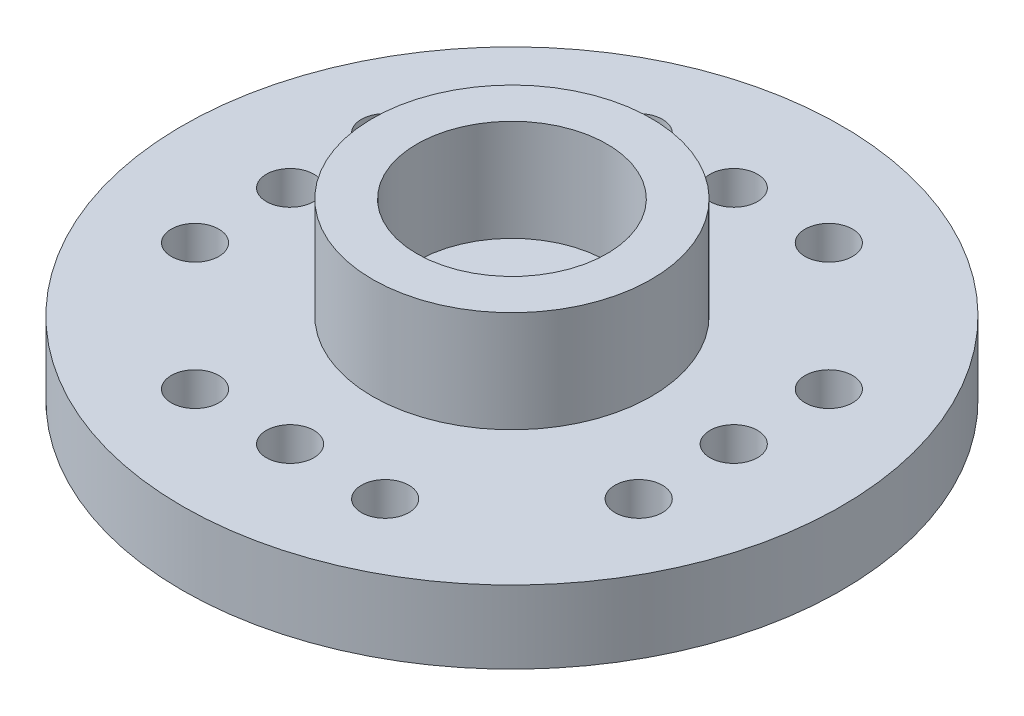
ISO-10303-21;
HEADER;
FILE_DESCRIPTION(('STEP AP214'),'2;1');
FILE_NAME('part.step','',(''),(''),'','','');
FILE_SCHEMA(('AUTOMOTIVE_DESIGN { 1 0 10303 214 1 1 1 1 }'));
ENDSEC;
DATA;
#1=APPLICATION_CONTEXT('core data for automotive mechanical design processes');
#2=APPLICATION_PROTOCOL_DEFINITION('international standard','automotive_design',2000,#1);
#3=PRODUCT_CONTEXT('',#1,'mechanical');
#4=PRODUCT('Part','Part','',(#3));
#5=PRODUCT_RELATED_PRODUCT_CATEGORY('part','',(#4));
#6=PRODUCT_DEFINITION_FORMATION('','',#4);
#7=PRODUCT_DEFINITION_CONTEXT('part definition',#1,'design');
#8=PRODUCT_DEFINITION('design','',#6,#7);
#9=PRODUCT_DEFINITION_SHAPE('','',#8);
#10=(LENGTH_UNIT() NAMED_UNIT(*) SI_UNIT(.MILLI.,.METRE.));
#11=(NAMED_UNIT(*) PLANE_ANGLE_UNIT() SI_UNIT($,.RADIAN.));
#12=(NAMED_UNIT(*) SI_UNIT($,.STERADIAN.) SOLID_ANGLE_UNIT());
#13=UNCERTAINTY_MEASURE_WITH_UNIT(LENGTH_MEASURE(1.E-05),#10,'distance_accuracy_value','');
#14=(GEOMETRIC_REPRESENTATION_CONTEXT(3) GLOBAL_UNCERTAINTY_ASSIGNED_CONTEXT((#13)) GLOBAL_UNIT_ASSIGNED_CONTEXT((#10,
#11,#12)) REPRESENTATION_CONTEXT('',''));
#15=CARTESIAN_POINT('',(0.,0.,0.));
#16=DIRECTION('',(0.,0.,1.));
#17=DIRECTION('',(1.,0.,0.));
#18=AXIS2_PLACEMENT_3D('',#15,#16,#17);
#19=CARTESIAN_POINT('',(0.,2.3,0.));
#20=DIRECTION('',(0.,1.,0.));
#21=DIRECTION('',(0.,0.,1.));
#22=AXIS2_PLACEMENT_3D('',#19,#20,#21);
#23=PLANE('',#22);
#24=CARTESIAN_POINT('',(0.,2.3,0.));
#25=DIRECTION('',(0.,1.,0.));
#26=DIRECTION('',(0.,0.,1.));
#27=AXIS2_PLACEMENT_3D('',#24,#25,#26);
#28=CIRCLE('',#27,1.5);
#29=CARTESIAN_POINT('',(0.,2.3,1.5));
#30=VERTEX_POINT('',#29);
#31=EDGE_CURVE('E119',#30,#30,#28,.T.);
#32=ORIENTED_EDGE('',*,*,#31,.F.);
#33=EDGE_LOOP('',(#32));
#34=FACE_BOUND('',#33,.T.);
#35=CARTESIAN_POINT('',(0.,2.3,0.));
#36=DIRECTION('',(0.,1.,0.));
#37=DIRECTION('',(0.,0.,1.));
#38=AXIS2_PLACEMENT_3D('',#35,#36,#37);
#39=CIRCLE('',#38,3.);
#40=CARTESIAN_POINT('',(0.,2.3,3.));
#41=VERTEX_POINT('',#40);
#42=EDGE_CURVE('E10',#41,#41,#39,.F.);
#43=ORIENTED_EDGE('',*,*,#42,.F.);
#44=EDGE_LOOP('',(#43));
#45=FACE_BOUND('',#44,.T.);
#46=ADVANCED_FACE('F32',(#34,#45),#23,.T.);
#47=CARTESIAN_POINT('',(0.,2.3,0.));
#48=DIRECTION('',(0.,1.,0.));
#49=DIRECTION('',(0.,0.,1.));
#50=AXIS2_PLACEMENT_3D('',#47,#48,#49);
#51=CIRCLE('',#50,4.4);
#52=CARTESIAN_POINT('',(0.,2.3,4.4));
#53=VERTEX_POINT('',#52);
#54=EDGE_CURVE('E128',#53,#53,#51,.T.);
#55=ORIENTED_EDGE('',*,*,#54,.F.);
#56=EDGE_LOOP('',(#55));
#57=FACE_BOUND('',#56,.T.);
#58=CARTESIAN_POINT('',(3.,2.3,-7.));
#59=DIRECTION('',(0.,1.,0.));
#60=DIRECTION('',(0.,0.,-1.));
#61=AXIS2_PLACEMENT_3D('',#58,#59,#60);
#62=CIRCLE('',#61,0.75);
#63=CARTESIAN_POINT('',(3.,2.3,-7.75));
#64=VERTEX_POINT('',#63);
#65=EDGE_CURVE('E113',#64,#64,#62,.T.);
#66=ORIENTED_EDGE('',*,*,#65,.F.);
#67=EDGE_LOOP('',(#66));
#68=FACE_BOUND('',#67,.T.);
#69=CARTESIAN_POINT('',(-3.,2.3,-7.));
#70=DIRECTION('',(0.,1.,0.));
#71=DIRECTION('',(0.,0.,-1.));
#72=AXIS2_PLACEMENT_3D('',#69,#70,#71);
#73=CIRCLE('',#72,0.750000000000002);
#74=CARTESIAN_POINT('',(-3.,2.3,-7.75));
#75=VERTEX_POINT('',#74);
#76=EDGE_CURVE('E101',#75,#75,#73,.T.);
#77=ORIENTED_EDGE('',*,*,#76,.F.);
#78=EDGE_LOOP('',(#77));
#79=FACE_BOUND('',#78,.T.);
#80=CARTESIAN_POINT('',(-7.,2.3,0.));
#81=DIRECTION('',(0.,1.,0.));
#82=DIRECTION('',(0.,0.,1.));
#83=AXIS2_PLACEMENT_3D('',#80,#81,#82);
#84=CIRCLE('',#83,0.749999999999999);
#85=CARTESIAN_POINT('',(-7.,2.3,0.750000000000004));
#86=VERTEX_POINT('',#85);
#87=EDGE_CURVE('E89',#86,#86,#84,.T.);
#88=ORIENTED_EDGE('',*,*,#87,.F.);
#89=EDGE_LOOP('',(#88));
#90=FACE_BOUND('',#89,.T.);
#91=CARTESIAN_POINT('',(-3.00000000000001,2.3,6.99999999999999));
#92=DIRECTION('',(0.,1.,0.));
#93=DIRECTION('',(0.,0.,-1.));
#94=AXIS2_PLACEMENT_3D('',#91,#92,#93);
#95=CIRCLE('',#94,0.75);
#96=CARTESIAN_POINT('',(-3.00000000000001,2.3,6.24999999999999));
#97=VERTEX_POINT('',#96);
#98=EDGE_CURVE('E77',#97,#97,#95,.T.);
#99=ORIENTED_EDGE('',*,*,#98,.F.);
#100=EDGE_LOOP('',(#99));
#101=FACE_BOUND('',#100,.T.);
#102=CARTESIAN_POINT('',(2.99999999999999,2.3,6.99999999999999));
#103=DIRECTION('',(0.,1.,0.));
#104=DIRECTION('',(0.,0.,-1.));
#105=AXIS2_PLACEMENT_3D('',#102,#103,#104);
#106=CIRCLE('',#105,0.749999999999998);
#107=CARTESIAN_POINT('',(2.99999999999999,2.3,6.24999999999999));
#108=VERTEX_POINT('',#107);
#109=EDGE_CURVE('E65',#108,#108,#106,.T.);
#110=ORIENTED_EDGE('',*,*,#109,.F.);
#111=EDGE_LOOP('',(#110));
#112=FACE_BOUND('',#111,.T.);
#113=CARTESIAN_POINT('',(7.,2.3,-3.));
#114=DIRECTION('',(0.,1.,0.));
#115=DIRECTION('',(0.,0.,1.));
#116=AXIS2_PLACEMENT_3D('',#113,#114,#115);
#117=CIRCLE('',#116,0.75);
#118=CARTESIAN_POINT('',(7.,2.3,-2.25));
#119=VERTEX_POINT('',#118);
#120=EDGE_CURVE('E53',#119,#119,#117,.T.);
#121=ORIENTED_EDGE('',*,*,#120,.F.);
#122=EDGE_LOOP('',(#121));
#123=FACE_BOUND('',#122,.T.);
#124=CARTESIAN_POINT('',(0.,2.3,0.));
#125=DIRECTION('',(0.,1.,0.));
#126=DIRECTION('',(0.,0.,1.));
#127=AXIS2_PLACEMENT_3D('',#124,#125,#126);
#128=CIRCLE('',#127,10.4);
#129=CARTESIAN_POINT('',(0.,2.3,10.4));
#130=VERTEX_POINT('',#129);
#131=EDGE_CURVE('E39',#130,#130,#128,.T.);
#132=ORIENTED_EDGE('',*,*,#131,.T.);
#133=EDGE_LOOP('',(#132));
#134=FACE_BOUND('',#133,.T.);
#135=CARTESIAN_POINT('',(7.,2.3,0.));
#136=DIRECTION('',(0.,1.,0.));
#137=DIRECTION('',(0.,0.,1.));
#138=AXIS2_PLACEMENT_3D('',#135,#136,#137);
#139=CIRCLE('',#138,0.75);
#140=CARTESIAN_POINT('',(7.,2.3,0.749999999999998));
#141=VERTEX_POINT('',#140);
#142=EDGE_CURVE('E48',#141,#141,#139,.T.);
#143=ORIENTED_EDGE('',*,*,#142,.F.);
#144=EDGE_LOOP('',(#143));
#145=FACE_BOUND('',#144,.T.);
#146=CARTESIAN_POINT('',(7.,2.3,3.));
#147=DIRECTION('',(0.,1.,0.));
#148=DIRECTION('',(0.,0.,1.));
#149=AXIS2_PLACEMENT_3D('',#146,#147,#148);
#150=CIRCLE('',#149,0.75);
#151=CARTESIAN_POINT('',(7.,2.3,3.75));
#152=VERTEX_POINT('',#151);
#153=EDGE_CURVE('E59',#152,#152,#150,.T.);
#154=ORIENTED_EDGE('',*,*,#153,.F.);
#155=EDGE_LOOP('',(#154));
#156=FACE_BOUND('',#155,.T.);
#157=CARTESIAN_POINT('',(0.,2.3,6.99999999999999));
#158=DIRECTION('',(0.,1.,0.));
#159=DIRECTION('',(0.,0.,-1.));
#160=AXIS2_PLACEMENT_3D('',#157,#158,#159);
#161=CIRCLE('',#160,0.75);
#162=CARTESIAN_POINT('',(0.,2.3,6.24999999999999));
#163=VERTEX_POINT('',#162);
#164=EDGE_CURVE('E71',#163,#163,#161,.T.);
#165=ORIENTED_EDGE('',*,*,#164,.F.);
#166=EDGE_LOOP('',(#165));
#167=FACE_BOUND('',#166,.T.);
#168=CARTESIAN_POINT('',(-7.,2.3,3.));
#169=DIRECTION('',(0.,1.,0.));
#170=DIRECTION('',(0.,0.,1.));
#171=AXIS2_PLACEMENT_3D('',#168,#169,#170);
#172=CIRCLE('',#171,0.749999999999999);
#173=CARTESIAN_POINT('',(-7.,2.3,3.75));
#174=VERTEX_POINT('',#173);
#175=EDGE_CURVE('E83',#174,#174,#172,.T.);
#176=ORIENTED_EDGE('',*,*,#175,.F.);
#177=EDGE_LOOP('',(#176));
#178=FACE_BOUND('',#177,.T.);
#179=CARTESIAN_POINT('',(-6.99999999999999,2.3,-2.99999999999999));
#180=DIRECTION('',(0.,1.,0.));
#181=DIRECTION('',(0.,0.,1.));
#182=AXIS2_PLACEMENT_3D('',#179,#180,#181);
#183=CIRCLE('',#182,0.749999999999998);
#184=CARTESIAN_POINT('',(-6.99999999999999,2.3,-2.25));
#185=VERTEX_POINT('',#184);
#186=EDGE_CURVE('E95',#185,#185,#183,.T.);
#187=ORIENTED_EDGE('',*,*,#186,.F.);
#188=EDGE_LOOP('',(#187));
#189=FACE_BOUND('',#188,.T.);
#190=CARTESIAN_POINT('',(0.,2.3,-7.));
#191=DIRECTION('',(0.,1.,0.));
#192=DIRECTION('',(0.,0.,-1.));
#193=AXIS2_PLACEMENT_3D('',#190,#191,#192);
#194=CIRCLE('',#193,0.749999999999998);
#195=CARTESIAN_POINT('',(0.,2.3,-7.75));
#196=VERTEX_POINT('',#195);
#197=EDGE_CURVE('E107',#196,#196,#194,.T.);
#198=ORIENTED_EDGE('',*,*,#197,.F.);
#199=EDGE_LOOP('',(#198));
#200=FACE_BOUND('',#199,.T.);
#201=ADVANCED_FACE('F156',(#57,#68,#79,#90,#101,#112,#123,#134,#145,#156,#167,#178,#189,#200),
#23,.T.);
#202=CARTESIAN_POINT('',(0.,0.,0.));
#203=DIRECTION('',(0.,1.,0.));
#204=DIRECTION('',(0.,0.,1.));
#205=AXIS2_PLACEMENT_3D('',#202,#203,#204);
#206=PLANE('',#205);
#207=CARTESIAN_POINT('',(0.,0.,0.));
#208=DIRECTION('',(0.,1.,0.));
#209=DIRECTION('',(0.,0.,1.));
#210=AXIS2_PLACEMENT_3D('',#207,#208,#209);
#211=CIRCLE('',#210,10.4);
#212=CARTESIAN_POINT('',(0.,0.,10.4));
#213=VERTEX_POINT('',#212);
#214=EDGE_CURVE('E43',#213,#213,#211,.T.);
#215=ORIENTED_EDGE('',*,*,#214,.F.);
#216=EDGE_LOOP('',(#215));
#217=FACE_BOUND('',#216,.T.);
#218=CARTESIAN_POINT('',(7.,0.,0.));
#219=DIRECTION('',(0.,1.,0.));
#220=DIRECTION('',(0.,0.,1.));
#221=AXIS2_PLACEMENT_3D('',#218,#219,#220);
#222=CIRCLE('',#221,0.75);
#223=CARTESIAN_POINT('',(7.,0.,0.749999999999998));
#224=VERTEX_POINT('',#223);
#225=EDGE_CURVE('E50',#224,#224,#222,.T.);
#226=ORIENTED_EDGE('',*,*,#225,.T.);
#227=EDGE_LOOP('',(#226));
#228=FACE_BOUND('',#227,.T.);
#229=CARTESIAN_POINT('',(7.,0.,-3.));
#230=DIRECTION('',(0.,1.,0.));
#231=DIRECTION('',(0.,0.,1.));
#232=AXIS2_PLACEMENT_3D('',#229,#230,#231);
#233=CIRCLE('',#232,0.75);
#234=CARTESIAN_POINT('',(7.,0.,-2.25));
#235=VERTEX_POINT('',#234);
#236=EDGE_CURVE('E56',#235,#235,#233,.T.);
#237=ORIENTED_EDGE('',*,*,#236,.T.);
#238=EDGE_LOOP('',(#237));
#239=FACE_BOUND('',#238,.T.);
#240=CARTESIAN_POINT('',(7.,0.,3.));
#241=DIRECTION('',(0.,1.,0.));
#242=DIRECTION('',(0.,0.,1.));
#243=AXIS2_PLACEMENT_3D('',#240,#241,#242);
#244=CIRCLE('',#243,0.75);
#245=CARTESIAN_POINT('',(7.,0.,3.75));
#246=VERTEX_POINT('',#245);
#247=EDGE_CURVE('E62',#246,#246,#244,.T.);
#248=ORIENTED_EDGE('',*,*,#247,.T.);
#249=EDGE_LOOP('',(#248));
#250=FACE_BOUND('',#249,.T.);
#251=CARTESIAN_POINT('',(2.99999999999999,0.,6.99999999999999));
#252=DIRECTION('',(0.,1.,0.));
#253=DIRECTION('',(0.,0.,-1.));
#254=AXIS2_PLACEMENT_3D('',#251,#252,#253);
#255=CIRCLE('',#254,0.749999999999998);
#256=CARTESIAN_POINT('',(2.99999999999999,0.,6.24999999999999));
#257=VERTEX_POINT('',#256);
#258=EDGE_CURVE('E68',#257,#257,#255,.T.);
#259=ORIENTED_EDGE('',*,*,#258,.T.);
#260=EDGE_LOOP('',(#259));
#261=FACE_BOUND('',#260,.T.);
#262=CARTESIAN_POINT('',(0.,0.,6.99999999999999));
#263=DIRECTION('',(0.,1.,0.));
#264=DIRECTION('',(0.,0.,-1.));
#265=AXIS2_PLACEMENT_3D('',#262,#263,#264);
#266=CIRCLE('',#265,0.75);
#267=CARTESIAN_POINT('',(0.,0.,6.24999999999999));
#268=VERTEX_POINT('',#267);
#269=EDGE_CURVE('E74',#268,#268,#266,.T.);
#270=ORIENTED_EDGE('',*,*,#269,.T.);
#271=EDGE_LOOP('',(#270));
#272=FACE_BOUND('',#271,.T.);
#273=CARTESIAN_POINT('',(-3.00000000000001,0.,6.99999999999999));
#274=DIRECTION('',(0.,1.,0.));
#275=DIRECTION('',(0.,0.,-1.));
#276=AXIS2_PLACEMENT_3D('',#273,#274,#275);
#277=CIRCLE('',#276,0.75);
#278=CARTESIAN_POINT('',(-3.00000000000001,0.,6.24999999999999));
#279=VERTEX_POINT('',#278);
#280=EDGE_CURVE('E80',#279,#279,#277,.T.);
#281=ORIENTED_EDGE('',*,*,#280,.T.);
#282=EDGE_LOOP('',(#281));
#283=FACE_BOUND('',#282,.T.);
#284=CARTESIAN_POINT('',(-7.,0.,3.));
#285=DIRECTION('',(0.,1.,0.));
#286=DIRECTION('',(0.,0.,1.));
#287=AXIS2_PLACEMENT_3D('',#284,#285,#286);
#288=CIRCLE('',#287,0.749999999999999);
#289=CARTESIAN_POINT('',(-7.,0.,3.75));
#290=VERTEX_POINT('',#289);
#291=EDGE_CURVE('E86',#290,#290,#288,.T.);
#292=ORIENTED_EDGE('',*,*,#291,.T.);
#293=EDGE_LOOP('',(#292));
#294=FACE_BOUND('',#293,.T.);
#295=CARTESIAN_POINT('',(-7.,0.,0.));
#296=DIRECTION('',(0.,1.,0.));
#297=DIRECTION('',(0.,0.,1.));
#298=AXIS2_PLACEMENT_3D('',#295,#296,#297);
#299=CIRCLE('',#298,0.749999999999999);
#300=CARTESIAN_POINT('',(-7.,0.,0.750000000000004));
#301=VERTEX_POINT('',#300);
#302=EDGE_CURVE('E92',#301,#301,#299,.T.);
#303=ORIENTED_EDGE('',*,*,#302,.T.);
#304=EDGE_LOOP('',(#303));
#305=FACE_BOUND('',#304,.T.);
#306=CARTESIAN_POINT('',(-6.99999999999999,0.,-2.99999999999999));
#307=DIRECTION('',(0.,1.,0.));
#308=DIRECTION('',(0.,0.,1.));
#309=AXIS2_PLACEMENT_3D('',#306,#307,#308);
#310=CIRCLE('',#309,0.749999999999998);
#311=CARTESIAN_POINT('',(-6.99999999999999,0.,-2.25));
#312=VERTEX_POINT('',#311);
#313=EDGE_CURVE('E98',#312,#312,#310,.T.);
#314=ORIENTED_EDGE('',*,*,#313,.T.);
#315=EDGE_LOOP('',(#314));
#316=FACE_BOUND('',#315,.T.);
#317=CARTESIAN_POINT('',(-3.,0.,-7.));
#318=DIRECTION('',(0.,1.,0.));
#319=DIRECTION('',(0.,0.,-1.));
#320=AXIS2_PLACEMENT_3D('',#317,#318,#319);
#321=CIRCLE('',#320,0.750000000000002);
#322=CARTESIAN_POINT('',(-3.,0.,-7.75));
#323=VERTEX_POINT('',#322);
#324=EDGE_CURVE('E104',#323,#323,#321,.T.);
#325=ORIENTED_EDGE('',*,*,#324,.T.);
#326=EDGE_LOOP('',(#325));
#327=FACE_BOUND('',#326,.T.);
#328=CARTESIAN_POINT('',(0.,0.,-7.));
#329=DIRECTION('',(0.,1.,0.));
#330=DIRECTION('',(0.,0.,-1.));
#331=AXIS2_PLACEMENT_3D('',#328,#329,#330);
#332=CIRCLE('',#331,0.749999999999998);
#333=CARTESIAN_POINT('',(0.,0.,-7.75));
#334=VERTEX_POINT('',#333);
#335=EDGE_CURVE('E110',#334,#334,#332,.T.);
#336=ORIENTED_EDGE('',*,*,#335,.T.);
#337=EDGE_LOOP('',(#336));
#338=FACE_BOUND('',#337,.T.);
#339=CARTESIAN_POINT('',(3.,0.,-7.));
#340=DIRECTION('',(0.,1.,0.));
#341=DIRECTION('',(0.,0.,-1.));
#342=AXIS2_PLACEMENT_3D('',#339,#340,#341);
#343=CIRCLE('',#342,0.75);
#344=CARTESIAN_POINT('',(3.,0.,-7.75));
#345=VERTEX_POINT('',#344);
#346=EDGE_CURVE('E116',#345,#345,#343,.T.);
#347=ORIENTED_EDGE('',*,*,#346,.T.);
#348=EDGE_LOOP('',(#347));
#349=FACE_BOUND('',#348,.T.);
#350=CARTESIAN_POINT('',(0.,0.,0.));
#351=DIRECTION('',(0.,1.,0.));
#352=DIRECTION('',(0.,0.,1.));
#353=AXIS2_PLACEMENT_3D('',#350,#351,#352);
#354=CIRCLE('',#353,1.5);
#355=CARTESIAN_POINT('',(0.,0.,1.5));
#356=VERTEX_POINT('',#355);
#357=EDGE_CURVE('E122',#356,#356,#354,.T.);
#358=ORIENTED_EDGE('',*,*,#357,.T.);
#359=EDGE_LOOP('',(#358));
#360=FACE_BOUND('',#359,.T.);
#361=ADVANCED_FACE('F162',(#217,#228,#239,#250,#261,#272,#283,#294,#305,#316,#327,#338,#349,
#360),#206,.F.);
#362=CARTESIAN_POINT('',(0.,2.3,0.));
#363=DIRECTION('',(0.,-1.,0.));
#364=DIRECTION('',(0.,0.,-1.));
#365=AXIS2_PLACEMENT_3D('',#362,#363,#364);
#366=CYLINDRICAL_SURFACE('',#365,10.4);
#367=ORIENTED_EDGE('',*,*,#131,.F.);
#368=EDGE_LOOP('',(#367));
#369=FACE_BOUND('',#368,.T.);
#370=ORIENTED_EDGE('',*,*,#214,.T.);
#371=EDGE_LOOP('',(#370));
#372=FACE_BOUND('',#371,.T.);
#373=ADVANCED_FACE('F34',(#369,#372),#366,.T.);
#374=CARTESIAN_POINT('',(7.,2.3,0.));
#375=DIRECTION('',(0.,-1.,0.));
#376=DIRECTION('',(0.,0.,-1.));
#377=AXIS2_PLACEMENT_3D('',#374,#375,#376);
#378=CYLINDRICAL_SURFACE('',#377,0.75);
#379=ORIENTED_EDGE('',*,*,#142,.T.);
#380=EDGE_LOOP('',(#379));
#381=FACE_BOUND('',#380,.T.);
#382=ORIENTED_EDGE('',*,*,#225,.F.);
#383=EDGE_LOOP('',(#382));
#384=FACE_BOUND('',#383,.T.);
#385=ADVANCED_FACE('F167',(#381,#384),#378,.F.);
#386=CARTESIAN_POINT('',(7.,2.3,-3.));
#387=DIRECTION('',(0.,-1.,0.));
#388=DIRECTION('',(0.,0.,-1.));
#389=AXIS2_PLACEMENT_3D('',#386,#387,#388);
#390=CYLINDRICAL_SURFACE('',#389,0.75);
#391=ORIENTED_EDGE('',*,*,#120,.T.);
#392=EDGE_LOOP('',(#391));
#393=FACE_BOUND('',#392,.T.);
#394=ORIENTED_EDGE('',*,*,#236,.F.);
#395=EDGE_LOOP('',(#394));
#396=FACE_BOUND('',#395,.T.);
#397=ADVANCED_FACE('F244',(#393,#396),#390,.F.);
#398=CARTESIAN_POINT('',(7.,2.3,3.));
#399=DIRECTION('',(0.,-1.,0.));
#400=DIRECTION('',(0.,0.,-1.));
#401=AXIS2_PLACEMENT_3D('',#398,#399,#400);
#402=CYLINDRICAL_SURFACE('',#401,0.75);
#403=ORIENTED_EDGE('',*,*,#153,.T.);
#404=EDGE_LOOP('',(#403));
#405=FACE_BOUND('',#404,.T.);
#406=ORIENTED_EDGE('',*,*,#247,.F.);
#407=EDGE_LOOP('',(#406));
#408=FACE_BOUND('',#407,.T.);
#409=ADVANCED_FACE('F241',(#405,#408),#402,.F.);
#410=CARTESIAN_POINT('',(2.99999999999999,2.3,6.99999999999999));
#411=DIRECTION('',(0.,-1.,0.));
#412=DIRECTION('',(0.,0.,-1.));
#413=AXIS2_PLACEMENT_3D('',#410,#411,#412);
#414=CYLINDRICAL_SURFACE('',#413,0.749999999999998);
#415=ORIENTED_EDGE('',*,*,#109,.T.);
#416=EDGE_LOOP('',(#415));
#417=FACE_BOUND('',#416,.T.);
#418=ORIENTED_EDGE('',*,*,#258,.F.);
#419=EDGE_LOOP('',(#418));
#420=FACE_BOUND('',#419,.T.);
#421=ADVANCED_FACE('F237',(#417,#420),#414,.F.);
#422=CARTESIAN_POINT('',(0.,2.3,6.99999999999999));
#423=DIRECTION('',(0.,-1.,0.));
#424=DIRECTION('',(0.,0.,-1.));
#425=AXIS2_PLACEMENT_3D('',#422,#423,#424);
#426=CYLINDRICAL_SURFACE('',#425,0.75);
#427=ORIENTED_EDGE('',*,*,#164,.T.);
#428=EDGE_LOOP('',(#427));
#429=FACE_BOUND('',#428,.T.);
#430=ORIENTED_EDGE('',*,*,#269,.F.);
#431=EDGE_LOOP('',(#430));
#432=FACE_BOUND('',#431,.T.);
#433=ADVANCED_FACE('F233',(#429,#432),#426,.F.);
#434=CARTESIAN_POINT('',(-3.00000000000001,2.3,6.99999999999999));
#435=DIRECTION('',(0.,-1.,0.));
#436=DIRECTION('',(0.,0.,-1.));
#437=AXIS2_PLACEMENT_3D('',#434,#435,#436);
#438=CYLINDRICAL_SURFACE('',#437,0.75);
#439=ORIENTED_EDGE('',*,*,#98,.T.);
#440=EDGE_LOOP('',(#439));
#441=FACE_BOUND('',#440,.T.);
#442=ORIENTED_EDGE('',*,*,#280,.F.);
#443=EDGE_LOOP('',(#442));
#444=FACE_BOUND('',#443,.T.);
#445=ADVANCED_FACE('F229',(#441,#444),#438,.F.);
#446=CARTESIAN_POINT('',(-7.,2.3,3.));
#447=DIRECTION('',(0.,-1.,0.));
#448=DIRECTION('',(0.,0.,-1.));
#449=AXIS2_PLACEMENT_3D('',#446,#447,#448);
#450=CYLINDRICAL_SURFACE('',#449,0.749999999999999);
#451=ORIENTED_EDGE('',*,*,#175,.T.);
#452=EDGE_LOOP('',(#451));
#453=FACE_BOUND('',#452,.T.);
#454=ORIENTED_EDGE('',*,*,#291,.F.);
#455=EDGE_LOOP('',(#454));
#456=FACE_BOUND('',#455,.T.);
#457=ADVANCED_FACE('F225',(#453,#456),#450,.F.);
#458=CARTESIAN_POINT('',(-7.,2.3,0.));
#459=DIRECTION('',(0.,-1.,0.));
#460=DIRECTION('',(0.,0.,-1.));
#461=AXIS2_PLACEMENT_3D('',#458,#459,#460);
#462=CYLINDRICAL_SURFACE('',#461,0.749999999999999);
#463=ORIENTED_EDGE('',*,*,#87,.T.);
#464=EDGE_LOOP('',(#463));
#465=FACE_BOUND('',#464,.T.);
#466=ORIENTED_EDGE('',*,*,#302,.F.);
#467=EDGE_LOOP('',(#466));
#468=FACE_BOUND('',#467,.T.);
#469=ADVANCED_FACE('F221',(#465,#468),#462,.F.);
#470=CARTESIAN_POINT('',(-6.99999999999999,2.3,-2.99999999999999));
#471=DIRECTION('',(0.,-1.,0.));
#472=DIRECTION('',(0.,0.,-1.));
#473=AXIS2_PLACEMENT_3D('',#470,#471,#472);
#474=CYLINDRICAL_SURFACE('',#473,0.749999999999998);
#475=ORIENTED_EDGE('',*,*,#186,.T.);
#476=EDGE_LOOP('',(#475));
#477=FACE_BOUND('',#476,.T.);
#478=ORIENTED_EDGE('',*,*,#313,.F.);
#479=EDGE_LOOP('',(#478));
#480=FACE_BOUND('',#479,.T.);
#481=ADVANCED_FACE('F217',(#477,#480),#474,.F.);
#482=CARTESIAN_POINT('',(-3.,2.3,-7.));
#483=DIRECTION('',(0.,-1.,0.));
#484=DIRECTION('',(0.,0.,-1.));
#485=AXIS2_PLACEMENT_3D('',#482,#483,#484);
#486=CYLINDRICAL_SURFACE('',#485,0.750000000000002);
#487=ORIENTED_EDGE('',*,*,#76,.T.);
#488=EDGE_LOOP('',(#487));
#489=FACE_BOUND('',#488,.T.);
#490=ORIENTED_EDGE('',*,*,#324,.F.);
#491=EDGE_LOOP('',(#490));
#492=FACE_BOUND('',#491,.T.);
#493=ADVANCED_FACE('F211',(#489,#492),#486,.F.);
#494=CARTESIAN_POINT('',(0.,2.3,-7.));
#495=DIRECTION('',(0.,-1.,0.));
#496=DIRECTION('',(0.,0.,-1.));
#497=AXIS2_PLACEMENT_3D('',#494,#495,#496);
#498=CYLINDRICAL_SURFACE('',#497,0.749999999999998);
#499=ORIENTED_EDGE('',*,*,#197,.T.);
#500=EDGE_LOOP('',(#499));
#501=FACE_BOUND('',#500,.T.);
#502=ORIENTED_EDGE('',*,*,#335,.F.);
#503=EDGE_LOOP('',(#502));
#504=FACE_BOUND('',#503,.T.);
#505=ADVANCED_FACE('F205',(#501,#504),#498,.F.);
#506=CARTESIAN_POINT('',(3.,2.3,-7.));
#507=DIRECTION('',(0.,-1.,0.));
#508=DIRECTION('',(0.,0.,-1.));
#509=AXIS2_PLACEMENT_3D('',#506,#507,#508);
#510=CYLINDRICAL_SURFACE('',#509,0.75);
#511=ORIENTED_EDGE('',*,*,#65,.T.);
#512=EDGE_LOOP('',(#511));
#513=FACE_BOUND('',#512,.T.);
#514=ORIENTED_EDGE('',*,*,#346,.F.);
#515=EDGE_LOOP('',(#514));
#516=FACE_BOUND('',#515,.T.);
#517=ADVANCED_FACE('F151',(#513,#516),#510,.F.);
#518=CARTESIAN_POINT('',(0.,2.3,0.));
#519=DIRECTION('',(0.,-1.,0.));
#520=DIRECTION('',(0.,0.,-1.));
#521=AXIS2_PLACEMENT_3D('',#518,#519,#520);
#522=CYLINDRICAL_SURFACE('',#521,1.5);
#523=ORIENTED_EDGE('',*,*,#31,.T.);
#524=EDGE_LOOP('',(#523));
#525=FACE_BOUND('',#524,.T.);
#526=ORIENTED_EDGE('',*,*,#357,.F.);
#527=EDGE_LOOP('',(#526));
#528=FACE_BOUND('',#527,.T.);
#529=ADVANCED_FACE('F142',(#525,#528),#522,.F.);
#530=CARTESIAN_POINT('',(0.,5.5,0.));
#531=DIRECTION('',(0.,1.,0.));
#532=DIRECTION('',(0.,0.,1.));
#533=AXIS2_PLACEMENT_3D('',#530,#531,#532);
#534=PLANE('',#533);
#535=CARTESIAN_POINT('',(0.,5.5,0.));
#536=DIRECTION('',(0.,1.,0.));
#537=DIRECTION('',(0.,0.,1.));
#538=AXIS2_PLACEMENT_3D('',#535,#536,#537);
#539=CIRCLE('',#538,4.4);
#540=CARTESIAN_POINT('',(0.,5.5,4.4));
#541=VERTEX_POINT('',#540);
#542=EDGE_CURVE('E125',#541,#541,#539,.T.);
#543=ORIENTED_EDGE('',*,*,#542,.T.);
#544=EDGE_LOOP('',(#543));
#545=FACE_BOUND('',#544,.T.);
#546=CARTESIAN_POINT('',(0.,5.5,0.));
#547=DIRECTION('',(0.,1.,0.));
#548=DIRECTION('',(0.,0.,1.));
#549=AXIS2_PLACEMENT_3D('',#546,#547,#548);
#550=CIRCLE('',#549,3.);
#551=CARTESIAN_POINT('',(0.,5.5,3.));
#552=VERTEX_POINT('',#551);
#553=EDGE_CURVE('E131',#552,#552,#550,.T.);
#554=ORIENTED_EDGE('',*,*,#553,.F.);
#555=EDGE_LOOP('',(#554));
#556=FACE_BOUND('',#555,.T.);
#557=ADVANCED_FACE('F139',(#545,#556),#534,.T.);
#558=CARTESIAN_POINT('',(0.,5.5,0.));
#559=DIRECTION('',(0.,-1.,0.));
#560=DIRECTION('',(0.,0.,-1.));
#561=AXIS2_PLACEMENT_3D('',#558,#559,#560);
#562=CYLINDRICAL_SURFACE('',#561,4.4);
#563=ORIENTED_EDGE('',*,*,#542,.F.);
#564=EDGE_LOOP('',(#563));
#565=FACE_BOUND('',#564,.T.);
#566=ORIENTED_EDGE('',*,*,#54,.T.);
#567=EDGE_LOOP('',(#566));
#568=FACE_BOUND('',#567,.T.);
#569=ADVANCED_FACE('F141',(#565,#568),#562,.T.);
#570=CARTESIAN_POINT('',(0.,5.5,0.));
#571=DIRECTION('',(0.,-1.,0.));
#572=DIRECTION('',(0.,0.,-1.));
#573=AXIS2_PLACEMENT_3D('',#570,#571,#572);
#574=CYLINDRICAL_SURFACE('',#573,3.);
#575=ORIENTED_EDGE('',*,*,#553,.T.);
#576=EDGE_LOOP('',(#575));
#577=FACE_BOUND('',#576,.T.);
#578=ORIENTED_EDGE('',*,*,#42,.T.);
#579=EDGE_LOOP('',(#578));
#580=FACE_BOUND('',#579,.T.);
#581=ADVANCED_FACE('F137',(#577,#580),#574,.F.);
#582=CLOSED_SHELL('',(#46,#201,#361,#373,#385,#397,#409,#421,#433,#445,#457,#469,#481,#493,#505,
#517,#529,#557,#569,#581));
#583=MANIFOLD_SOLID_BREP('B2',#582);
#584=ADVANCED_BREP_SHAPE_REPRESENTATION('',(#18,#583),#14);
#585=SHAPE_DEFINITION_REPRESENTATION(#9,#584);
ENDSEC;
END-ISO-10303-21;
